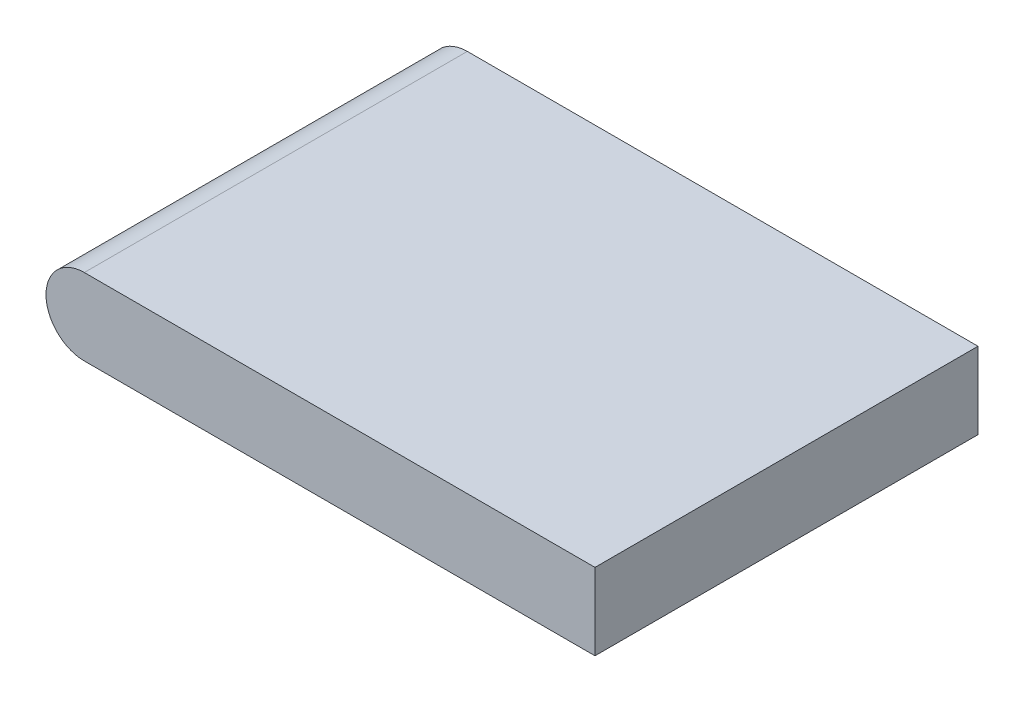
ISO-10303-21;
HEADER;
FILE_DESCRIPTION(('STEP AP214'),'2;1');
FILE_NAME('part.step','',(''),(''),'','','');
FILE_SCHEMA(('AUTOMOTIVE_DESIGN { 1 0 10303 214 1 1 1 1 }'));
ENDSEC;
DATA;
#1=APPLICATION_CONTEXT('core data for automotive mechanical design processes');
#2=APPLICATION_PROTOCOL_DEFINITION('international standard','automotive_design',2000,#1);
#3=PRODUCT_CONTEXT('',#1,'mechanical');
#4=PRODUCT('Part','Part','',(#3));
#5=PRODUCT_RELATED_PRODUCT_CATEGORY('part','',(#4));
#6=PRODUCT_DEFINITION_FORMATION('','',#4);
#7=PRODUCT_DEFINITION_CONTEXT('part definition',#1,'design');
#8=PRODUCT_DEFINITION('design','',#6,#7);
#9=PRODUCT_DEFINITION_SHAPE('','',#8);
#10=(LENGTH_UNIT() NAMED_UNIT(*) SI_UNIT(.MILLI.,.METRE.));
#11=(NAMED_UNIT(*) PLANE_ANGLE_UNIT() SI_UNIT($,.RADIAN.));
#12=(NAMED_UNIT(*) SI_UNIT($,.STERADIAN.) SOLID_ANGLE_UNIT());
#13=UNCERTAINTY_MEASURE_WITH_UNIT(LENGTH_MEASURE(1.E-05),#10,'distance_accuracy_value','');
#14=(GEOMETRIC_REPRESENTATION_CONTEXT(3) GLOBAL_UNCERTAINTY_ASSIGNED_CONTEXT((#13)) GLOBAL_UNIT_ASSIGNED_CONTEXT((#10,
#11,#12)) REPRESENTATION_CONTEXT('',''));
#15=CARTESIAN_POINT('',(0.,0.,0.));
#16=DIRECTION('',(0.,0.,1.));
#17=DIRECTION('',(1.,0.,0.));
#18=AXIS2_PLACEMENT_3D('',#15,#16,#17);
#19=CARTESIAN_POINT('',(0.,1.905,9.525));
#20=DIRECTION('',(0.,1.,0.));
#21=DIRECTION('',(0.,0.,1.));
#22=AXIS2_PLACEMENT_3D('',#19,#20,#21);
#23=PLANE('',#22);
#24=DIRECTION('',(1.,0.,0.));
#25=VECTOR('',#24,1.);
#26=CARTESIAN_POINT('',(0.,1.905,-9.525));
#27=LINE('',#26,#25);
#28=CARTESIAN_POINT('',(-12.7,1.905,-9.525));
#29=VERTEX_POINT('',#28);
#30=CARTESIAN_POINT('',(12.7,1.905,-9.525));
#31=VERTEX_POINT('',#30);
#32=EDGE_CURVE('E108',#29,#31,#27,.T.);
#33=ORIENTED_EDGE('',*,*,#32,.F.);
#34=DIRECTION('',(0.,0.,-1.));
#35=VECTOR('',#34,1.);
#36=CARTESIAN_POINT('',(-12.7,1.905,9.525));
#37=LINE('',#36,#35);
#38=CARTESIAN_POINT('',(-12.7,1.905,9.525));
#39=VERTEX_POINT('',#38);
#40=EDGE_CURVE('E11',#39,#29,#37,.T.);
#41=ORIENTED_EDGE('',*,*,#40,.F.);
#42=DIRECTION('',(1.,0.,0.));
#43=VECTOR('',#42,1.);
#44=CARTESIAN_POINT('',(0.,1.905,9.525));
#45=LINE('',#44,#43);
#46=CARTESIAN_POINT('',(12.7,1.905,9.525));
#47=VERTEX_POINT('',#46);
#48=EDGE_CURVE('E93',#39,#47,#45,.T.);
#49=ORIENTED_EDGE('',*,*,#48,.T.);
#50=DIRECTION('',(0.,0.,-1.));
#51=VECTOR('',#50,1.);
#52=CARTESIAN_POINT('',(12.7,1.905,9.525));
#53=LINE('',#52,#51);
#54=EDGE_CURVE('E61',#47,#31,#53,.T.);
#55=ORIENTED_EDGE('',*,*,#54,.T.);
#56=EDGE_LOOP('',(#33,#41,#49,#55));
#57=FACE_BOUND('',#56,.T.);
#58=ADVANCED_FACE('F45',(#57),#23,.T.);
#59=CARTESIAN_POINT('',(-12.7,0.,9.525));
#60=DIRECTION('',(0.,0.,-1.));
#61=DIRECTION('',(-1.,0.,0.));
#62=AXIS2_PLACEMENT_3D('',#59,#60,#61);
#63=CYLINDRICAL_SURFACE('',#62,1.905);
#64=CARTESIAN_POINT('',(-12.7,0.,-9.525));
#65=DIRECTION('',(0.,0.,1.));
#66=DIRECTION('',(1.,0.,0.));
#67=AXIS2_PLACEMENT_3D('',#64,#65,#66);
#68=CIRCLE('',#67,1.905);
#69=CARTESIAN_POINT('',(-12.7,-1.905,-9.525));
#70=VERTEX_POINT('',#69);
#71=EDGE_CURVE('E99',#29,#70,#68,.T.);
#72=ORIENTED_EDGE('',*,*,#71,.T.);
#73=DIRECTION('',(0.,0.,-1.));
#74=VECTOR('',#73,1.);
#75=CARTESIAN_POINT('',(-12.7,-1.905,9.525));
#76=LINE('',#75,#74);
#77=CARTESIAN_POINT('',(-12.7,-1.905,9.525));
#78=VERTEX_POINT('',#77);
#79=EDGE_CURVE('E53',#78,#70,#76,.T.);
#80=ORIENTED_EDGE('',*,*,#79,.F.);
#81=CARTESIAN_POINT('',(-12.7,0.,9.525));
#82=DIRECTION('',(0.,0.,1.));
#83=DIRECTION('',(1.,0.,0.));
#84=AXIS2_PLACEMENT_3D('',#81,#82,#83);
#85=CIRCLE('',#84,1.905);
#86=EDGE_CURVE('E87',#39,#78,#85,.T.);
#87=ORIENTED_EDGE('',*,*,#86,.F.);
#88=ORIENTED_EDGE('',*,*,#40,.T.);
#89=EDGE_LOOP('',(#72,#80,#87,#88));
#90=FACE_BOUND('',#89,.T.);
#91=ADVANCED_FACE('F97',(#90),#63,.T.);
#92=CARTESIAN_POINT('',(0.,-1.905,9.525));
#93=DIRECTION('',(0.,1.,0.));
#94=DIRECTION('',(0.,0.,1.));
#95=AXIS2_PLACEMENT_3D('',#92,#93,#94);
#96=PLANE('',#95);
#97=DIRECTION('',(1.,0.,0.));
#98=VECTOR('',#97,1.);
#99=CARTESIAN_POINT('',(0.,-1.905,-9.525));
#100=LINE('',#99,#98);
#101=CARTESIAN_POINT('',(12.7,-1.905,-9.525));
#102=VERTEX_POINT('',#101);
#103=EDGE_CURVE('E111',#70,#102,#100,.T.);
#104=ORIENTED_EDGE('',*,*,#103,.T.);
#105=DIRECTION('',(0.,0.,-1.));
#106=VECTOR('',#105,1.);
#107=CARTESIAN_POINT('',(12.7,-1.905,9.525));
#108=LINE('',#107,#106);
#109=CARTESIAN_POINT('',(12.7,-1.905,9.525));
#110=VERTEX_POINT('',#109);
#111=EDGE_CURVE('E75',#110,#102,#108,.T.);
#112=ORIENTED_EDGE('',*,*,#111,.F.);
#113=DIRECTION('',(1.,0.,0.));
#114=VECTOR('',#113,1.);
#115=CARTESIAN_POINT('',(0.,-1.905,9.525));
#116=LINE('',#115,#114);
#117=EDGE_CURVE('E92',#78,#110,#116,.T.);
#118=ORIENTED_EDGE('',*,*,#117,.F.);
#119=ORIENTED_EDGE('',*,*,#79,.T.);
#120=EDGE_LOOP('',(#104,#112,#118,#119));
#121=FACE_BOUND('',#120,.T.);
#122=ADVANCED_FACE('F102',(#121),#96,.F.);
#123=CARTESIAN_POINT('',(12.7,0.,9.525));
#124=DIRECTION('',(1.,0.,0.));
#125=DIRECTION('',(0.,0.,-1.));
#126=AXIS2_PLACEMENT_3D('',#123,#124,#125);
#127=PLANE('',#126);
#128=DIRECTION('',(0.,-1.,0.));
#129=VECTOR('',#128,1.);
#130=CARTESIAN_POINT('',(12.7,0.,-9.525));
#131=LINE('',#130,#129);
#132=EDGE_CURVE('E113',#31,#102,#131,.T.);
#133=ORIENTED_EDGE('',*,*,#132,.F.);
#134=ORIENTED_EDGE('',*,*,#54,.F.);
#135=DIRECTION('',(0.,-1.,0.));
#136=VECTOR('',#135,1.);
#137=CARTESIAN_POINT('',(12.7,0.,9.525));
#138=LINE('',#137,#136);
#139=EDGE_CURVE('E103',#47,#110,#138,.T.);
#140=ORIENTED_EDGE('',*,*,#139,.T.);
#141=ORIENTED_EDGE('',*,*,#111,.T.);
#142=EDGE_LOOP('',(#133,#134,#140,#141));
#143=FACE_BOUND('',#142,.T.);
#144=ADVANCED_FACE('F118',(#143),#127,.T.);
#145=CARTESIAN_POINT('',(0.,0.,9.525));
#146=DIRECTION('',(0.,0.,1.));
#147=DIRECTION('',(1.,0.,0.));
#148=AXIS2_PLACEMENT_3D('',#145,#146,#147);
#149=PLANE('',#148);
#150=ORIENTED_EDGE('',*,*,#48,.F.);
#151=ORIENTED_EDGE('',*,*,#86,.T.);
#152=ORIENTED_EDGE('',*,*,#117,.T.);
#153=ORIENTED_EDGE('',*,*,#139,.F.);
#154=EDGE_LOOP('',(#150,#151,#152,#153));
#155=FACE_BOUND('',#154,.T.);
#156=ADVANCED_FACE('F89',(#155),#149,.T.);
#157=CARTESIAN_POINT('',(0.,0.,-9.525));
#158=DIRECTION('',(0.,0.,1.));
#159=DIRECTION('',(1.,0.,0.));
#160=AXIS2_PLACEMENT_3D('',#157,#158,#159);
#161=PLANE('',#160);
#162=ORIENTED_EDGE('',*,*,#32,.T.);
#163=ORIENTED_EDGE('',*,*,#132,.T.);
#164=ORIENTED_EDGE('',*,*,#103,.F.);
#165=ORIENTED_EDGE('',*,*,#71,.F.);
#166=EDGE_LOOP('',(#162,#163,#164,#165));
#167=FACE_BOUND('',#166,.T.);
#168=ADVANCED_FACE('F125',(#167),#161,.F.);
#169=CLOSED_SHELL('',(#58,#91,#122,#144,#156,#168));
#170=MANIFOLD_SOLID_BREP('B2',#169);
#171=ADVANCED_BREP_SHAPE_REPRESENTATION('',(#18,#170),#14);
#172=SHAPE_DEFINITION_REPRESENTATION(#9,#171);
ENDSEC;
END-ISO-10303-21;
